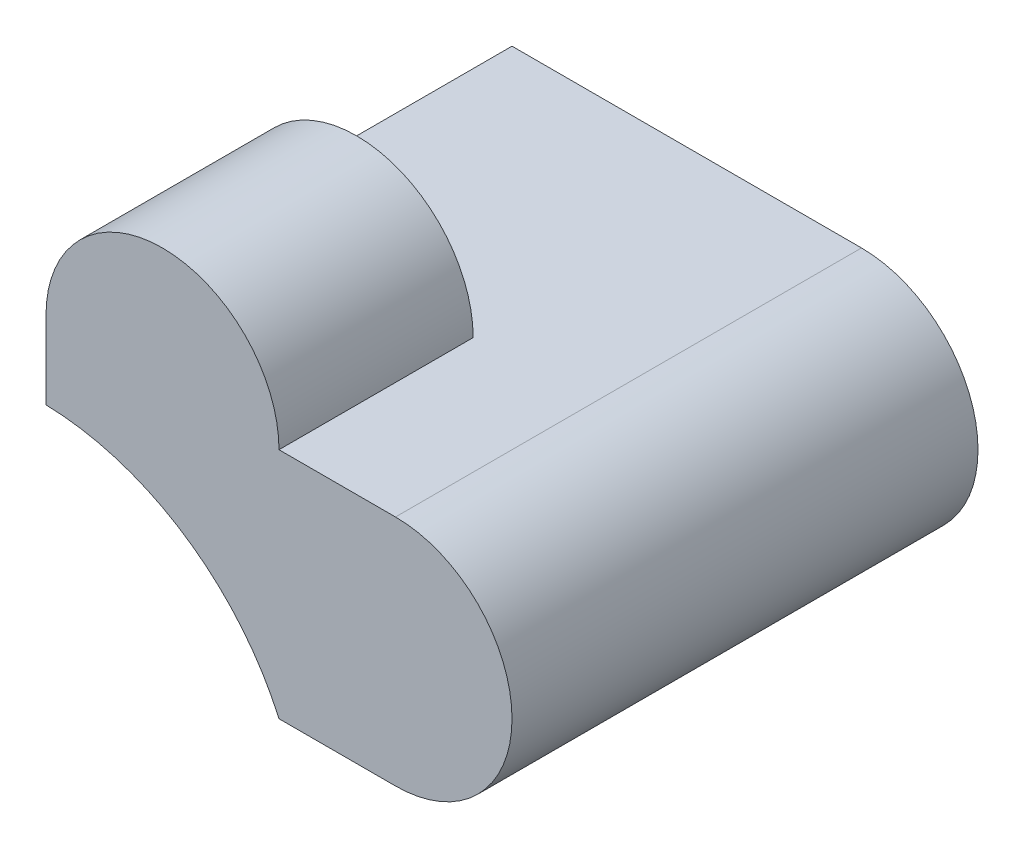
ISO-10303-21;
HEADER;
FILE_DESCRIPTION(('STEP AP214'),'2;1');
FILE_NAME('part.step','',(''),(''),'','','');
FILE_SCHEMA(('AUTOMOTIVE_DESIGN { 1 0 10303 214 1 1 1 1 }'));
ENDSEC;
DATA;
#1=APPLICATION_CONTEXT('core data for automotive mechanical design processes');
#2=APPLICATION_PROTOCOL_DEFINITION('international standard','automotive_design',2000,#1);
#3=PRODUCT_CONTEXT('',#1,'mechanical');
#4=PRODUCT('Part','Part','',(#3));
#5=PRODUCT_RELATED_PRODUCT_CATEGORY('part','',(#4));
#6=PRODUCT_DEFINITION_FORMATION('','',#4);
#7=PRODUCT_DEFINITION_CONTEXT('part definition',#1,'design');
#8=PRODUCT_DEFINITION('design','',#6,#7);
#9=PRODUCT_DEFINITION_SHAPE('','',#8);
#10=(LENGTH_UNIT() NAMED_UNIT(*) SI_UNIT(.MILLI.,.METRE.));
#11=(NAMED_UNIT(*) PLANE_ANGLE_UNIT() SI_UNIT($,.RADIAN.));
#12=(NAMED_UNIT(*) SI_UNIT($,.STERADIAN.) SOLID_ANGLE_UNIT());
#13=UNCERTAINTY_MEASURE_WITH_UNIT(LENGTH_MEASURE(1.E-05),#10,'distance_accuracy_value','');
#14=(GEOMETRIC_REPRESENTATION_CONTEXT(3) GLOBAL_UNCERTAINTY_ASSIGNED_CONTEXT((#13)) GLOBAL_UNIT_ASSIGNED_CONTEXT((#10,
#11,#12)) REPRESENTATION_CONTEXT('',''));
#15=CARTESIAN_POINT('',(0.,0.,0.));
#16=DIRECTION('',(0.,0.,1.));
#17=DIRECTION('',(1.,0.,0.));
#18=AXIS2_PLACEMENT_3D('',#15,#16,#17);
#19=CARTESIAN_POINT('',(0.,0.,0.));
#20=DIRECTION('',(0.,-1.,0.));
#21=DIRECTION('',(0.,0.,-1.));
#22=AXIS2_PLACEMENT_3D('',#19,#20,#21);
#23=PLANE('',#22);
#24=DIRECTION('',(1.,0.,0.));
#25=VECTOR('',#24,1.);
#26=CARTESIAN_POINT('',(-3.,0.,3.));
#27=LINE('',#26,#25);
#28=CARTESIAN_POINT('',(0.,0.,3.));
#29=VERTEX_POINT('',#28);
#30=CARTESIAN_POINT('',(1.5,0.,3.));
#31=VERTEX_POINT('',#30);
#32=EDGE_CURVE('E122',#29,#31,#27,.T.);
#33=ORIENTED_EDGE('',*,*,#32,.F.);
#34=DIRECTION('',(0.,0.,1.));
#35=VECTOR('',#34,1.);
#36=CARTESIAN_POINT('',(0.,0.,0.5));
#37=LINE('',#36,#35);
#38=CARTESIAN_POINT('',(0.,0.,0.5));
#39=VERTEX_POINT('',#38);
#40=EDGE_CURVE('E130',#39,#29,#37,.T.);
#41=ORIENTED_EDGE('',*,*,#40,.F.);
#42=DIRECTION('',(1.,0.,0.));
#43=VECTOR('',#42,1.);
#44=CARTESIAN_POINT('',(0.,0.,0.5));
#45=LINE('',#44,#43);
#46=CARTESIAN_POINT('',(-3.,0.,0.5));
#47=VERTEX_POINT('',#46);
#48=EDGE_CURVE('E121',#47,#39,#45,.T.);
#49=ORIENTED_EDGE('',*,*,#48,.F.);
#50=DIRECTION('',(0.,0.,1.));
#51=VECTOR('',#50,1.);
#52=CARTESIAN_POINT('',(-3.,0.,3.));
#53=LINE('',#52,#51);
#54=CARTESIAN_POINT('',(-3.,0.,-3.));
#55=VERTEX_POINT('',#54);
#56=EDGE_CURVE('E106',#55,#47,#53,.T.);
#57=ORIENTED_EDGE('',*,*,#56,.F.);
#58=DIRECTION('',(-1.,0.,0.));
#59=VECTOR('',#58,1.);
#60=CARTESIAN_POINT('',(-3.,0.,-3.));
#61=LINE('',#60,#59);
#62=CARTESIAN_POINT('',(1.5,0.,-3.));
#63=VERTEX_POINT('',#62);
#64=EDGE_CURVE('E97',#63,#55,#61,.T.);
#65=ORIENTED_EDGE('',*,*,#64,.F.);
#66=DIRECTION('',(0.,0.,1.));
#67=VECTOR('',#66,1.);
#68=CARTESIAN_POINT('',(1.5,0.,-7.));
#69=LINE('',#68,#67);
#70=EDGE_CURVE('E42',#63,#31,#69,.T.);
#71=ORIENTED_EDGE('',*,*,#70,.T.);
#72=EDGE_LOOP('',(#33,#41,#49,#57,#65,#71));
#73=FACE_BOUND('',#72,.T.);
#74=ADVANCED_FACE('F33',(#73),#23,.T.);
#75=CARTESIAN_POINT('',(-3.,5.,3.));
#76=DIRECTION('',(1.,0.,0.));
#77=DIRECTION('',(0.,0.,-1.));
#78=AXIS2_PLACEMENT_3D('',#75,#76,#77);
#79=PLANE('',#78);
#80=DIRECTION('',(0.,0.,1.));
#81=VECTOR('',#80,1.);
#82=CARTESIAN_POINT('',(-3.,2.,0.5));
#83=LINE('',#82,#81);
#84=CARTESIAN_POINT('',(-3.,2.,0.5));
#85=VERTEX_POINT('',#84);
#86=CARTESIAN_POINT('',(-3.,2.,3.));
#87=VERTEX_POINT('',#86);
#88=EDGE_CURVE('E135',#85,#87,#83,.T.);
#89=ORIENTED_EDGE('',*,*,#88,.T.);
#90=DIRECTION('',(0.,-1.,0.));
#91=VECTOR('',#90,1.);
#92=CARTESIAN_POINT('',(-3.,5.,3.));
#93=LINE('',#92,#91);
#94=CARTESIAN_POINT('',(-3.,3.,3.));
#95=VERTEX_POINT('',#94);
#96=EDGE_CURVE('E116',#95,#87,#93,.T.);
#97=ORIENTED_EDGE('',*,*,#96,.F.);
#98=DIRECTION('',(0.,0.,1.));
#99=VECTOR('',#98,1.);
#100=CARTESIAN_POINT('',(-3.,3.,-7.));
#101=LINE('',#100,#99);
#102=CARTESIAN_POINT('',(-3.,3.,0.5));
#103=VERTEX_POINT('',#102);
#104=EDGE_CURVE('E145',#103,#95,#101,.T.);
#105=ORIENTED_EDGE('',*,*,#104,.F.);
#106=CARTESIAN_POINT('',(-3.,3.,-3.));
#107=VERTEX_POINT('',#106);
#108=EDGE_CURVE('E115',#107,#103,#101,.T.);
#109=ORIENTED_EDGE('',*,*,#108,.F.);
#110=DIRECTION('',(0.,-1.,0.));
#111=VECTOR('',#110,1.);
#112=CARTESIAN_POINT('',(-3.,5.,-3.));
#113=LINE('',#112,#111);
#114=EDGE_CURVE('E100',#107,#55,#113,.T.);
#115=ORIENTED_EDGE('',*,*,#114,.T.);
#116=ORIENTED_EDGE('',*,*,#56,.T.);
#117=DIRECTION('',(0.,-1.,0.));
#118=VECTOR('',#117,1.);
#119=CARTESIAN_POINT('',(-3.,0.,0.5));
#120=LINE('',#119,#118);
#121=EDGE_CURVE('E194',#85,#47,#120,.T.);
#122=ORIENTED_EDGE('',*,*,#121,.F.);
#123=EDGE_LOOP('',(#89,#97,#105,#109,#115,#116,#122));
#124=FACE_BOUND('',#123,.T.);
#125=ADVANCED_FACE('F111',(#124),#79,.F.);
#126=CARTESIAN_POINT('',(-3.,5.,-3.));
#127=DIRECTION('',(0.,0.,1.));
#128=DIRECTION('',(1.,0.,0.));
#129=AXIS2_PLACEMENT_3D('',#126,#127,#128);
#130=PLANE('',#129);
#131=ORIENTED_EDGE('',*,*,#114,.F.);
#132=DIRECTION('',(1.,0.,0.));
#133=VECTOR('',#132,1.);
#134=CARTESIAN_POINT('',(-3.,3.,-3.));
#135=LINE('',#134,#133);
#136=CARTESIAN_POINT('',(1.5,3.,-3.));
#137=VERTEX_POINT('',#136);
#138=EDGE_CURVE('E148',#107,#137,#135,.T.);
#139=ORIENTED_EDGE('',*,*,#138,.T.);
#140=CARTESIAN_POINT('',(1.5,1.5,-3.));
#141=DIRECTION('',(0.,0.,1.));
#142=DIRECTION('',(1.,0.,0.));
#143=AXIS2_PLACEMENT_3D('',#140,#141,#142);
#144=CIRCLE('',#143,1.5);
#145=EDGE_CURVE('E101',#63,#137,#144,.T.);
#146=ORIENTED_EDGE('',*,*,#145,.F.);
#147=ORIENTED_EDGE('',*,*,#64,.T.);
#148=EDGE_LOOP('',(#131,#139,#146,#147));
#149=FACE_BOUND('',#148,.T.);
#150=ADVANCED_FACE('F35',(#149),#130,.F.);
#151=CARTESIAN_POINT('',(-3.,5.,3.));
#152=DIRECTION('',(0.,0.,-1.));
#153=DIRECTION('',(-1.,0.,0.));
#154=AXIS2_PLACEMENT_3D('',#151,#152,#153);
#155=PLANE('',#154);
#156=CARTESIAN_POINT('',(-3.08192997799912,-1.37289496699869,3.));
#157=DIRECTION('',(0.,0.,1.));
#158=DIRECTION('',(1.,0.,0.));
#159=AXIS2_PLACEMENT_3D('',#156,#157,#158);
#160=CIRCLE('',#159,3.37388988849666);
#161=EDGE_CURVE('E62',#87,#29,#160,.F.);
#162=ORIENTED_EDGE('',*,*,#161,.T.);
#163=ORIENTED_EDGE('',*,*,#32,.T.);
#164=CARTESIAN_POINT('',(1.5,1.5,3.));
#165=DIRECTION('',(0.,0.,1.));
#166=DIRECTION('',(1.,0.,0.));
#167=AXIS2_PLACEMENT_3D('',#164,#165,#166);
#168=CIRCLE('',#167,1.5);
#169=CARTESIAN_POINT('',(1.5,3.,3.));
#170=VERTEX_POINT('',#169);
#171=EDGE_CURVE('E129',#31,#170,#168,.T.);
#172=ORIENTED_EDGE('',*,*,#171,.T.);
#173=DIRECTION('',(1.,0.,0.));
#174=VECTOR('',#173,1.);
#175=CARTESIAN_POINT('',(0.,3.,3.));
#176=LINE('',#175,#174);
#177=CARTESIAN_POINT('',(0.,3.,3.));
#178=VERTEX_POINT('',#177);
#179=EDGE_CURVE('E142',#178,#170,#176,.T.);
#180=ORIENTED_EDGE('',*,*,#179,.F.);
#181=CARTESIAN_POINT('',(-1.5,3.,3.));
#182=DIRECTION('',(0.,0.,1.));
#183=DIRECTION('',(1.,0.,0.));
#184=AXIS2_PLACEMENT_3D('',#181,#182,#183);
#185=CIRCLE('',#184,1.5);
#186=EDGE_CURVE('E133',#95,#178,#185,.F.);
#187=ORIENTED_EDGE('',*,*,#186,.F.);
#188=ORIENTED_EDGE('',*,*,#96,.T.);
#189=EDGE_LOOP('',(#162,#163,#172,#180,#187,#188));
#190=FACE_BOUND('',#189,.T.);
#191=ADVANCED_FACE('F161',(#190),#155,.F.);
#192=CARTESIAN_POINT('',(1.5,1.5,-7.));
#193=DIRECTION('',(0.,0.,1.));
#194=DIRECTION('',(1.,0.,0.));
#195=AXIS2_PLACEMENT_3D('',#192,#193,#194);
#196=CYLINDRICAL_SURFACE('',#195,1.5);
#197=ORIENTED_EDGE('',*,*,#145,.T.);
#198=DIRECTION('',(0.,0.,1.));
#199=VECTOR('',#198,1.);
#200=CARTESIAN_POINT('',(1.5,3.,-7.));
#201=LINE('',#200,#199);
#202=EDGE_CURVE('E146',#137,#170,#201,.T.);
#203=ORIENTED_EDGE('',*,*,#202,.T.);
#204=ORIENTED_EDGE('',*,*,#171,.F.);
#205=ORIENTED_EDGE('',*,*,#70,.F.);
#206=EDGE_LOOP('',(#197,#203,#204,#205));
#207=FACE_BOUND('',#206,.T.);
#208=ADVANCED_FACE('F154',(#207),#196,.T.);
#209=CARTESIAN_POINT('',(0.,3.,-7.));
#210=DIRECTION('',(0.,-1.,0.));
#211=DIRECTION('',(0.,0.,-1.));
#212=AXIS2_PLACEMENT_3D('',#209,#210,#211);
#213=PLANE('',#212);
#214=ORIENTED_EDGE('',*,*,#179,.T.);
#215=ORIENTED_EDGE('',*,*,#202,.F.);
#216=ORIENTED_EDGE('',*,*,#138,.F.);
#217=ORIENTED_EDGE('',*,*,#108,.T.);
#218=DIRECTION('',(-1.,0.,0.));
#219=VECTOR('',#218,1.);
#220=CARTESIAN_POINT('',(9.5,3.,0.5));
#221=LINE('',#220,#219);
#222=CARTESIAN_POINT('',(0.,3.,0.5));
#223=VERTEX_POINT('',#222);
#224=EDGE_CURVE('E191',#223,#103,#221,.T.);
#225=ORIENTED_EDGE('',*,*,#224,.F.);
#226=DIRECTION('',(0.,0.,1.));
#227=VECTOR('',#226,1.);
#228=CARTESIAN_POINT('',(0.,3.,-7.));
#229=LINE('',#228,#227);
#230=EDGE_CURVE('E149',#223,#178,#229,.T.);
#231=ORIENTED_EDGE('',*,*,#230,.T.);
#232=EDGE_LOOP('',(#214,#215,#216,#217,#225,#231));
#233=FACE_BOUND('',#232,.T.);
#234=ADVANCED_FACE('F157',(#233),#213,.F.);
#235=CARTESIAN_POINT('',(-1.5,3.,-7.));
#236=DIRECTION('',(0.,0.,1.));
#237=DIRECTION('',(1.,0.,0.));
#238=AXIS2_PLACEMENT_3D('',#235,#236,#237);
#239=CYLINDRICAL_SURFACE('',#238,1.5);
#240=ORIENTED_EDGE('',*,*,#230,.F.);
#241=CARTESIAN_POINT('',(-1.5,3.,0.5));
#242=DIRECTION('',(0.,0.,1.));
#243=DIRECTION('',(1.,0.,0.));
#244=AXIS2_PLACEMENT_3D('',#241,#242,#243);
#245=CIRCLE('',#244,1.5);
#246=EDGE_CURVE('E11',#223,#103,#245,.T.);
#247=ORIENTED_EDGE('',*,*,#246,.T.);
#248=ORIENTED_EDGE('',*,*,#104,.T.);
#249=ORIENTED_EDGE('',*,*,#186,.T.);
#250=EDGE_LOOP('',(#240,#247,#248,#249));
#251=FACE_BOUND('',#250,.T.);
#252=ADVANCED_FACE('F175',(#251),#239,.T.);
#253=CARTESIAN_POINT('',(-3.08192997799912,-1.37289496699869,0.5));
#254=DIRECTION('',(0.,0.,1.));
#255=DIRECTION('',(1.,0.,0.));
#256=AXIS2_PLACEMENT_3D('',#253,#254,#255);
#257=CYLINDRICAL_SURFACE('',#256,3.37388988849666);
#258=ORIENTED_EDGE('',*,*,#161,.F.);
#259=ORIENTED_EDGE('',*,*,#88,.F.);
#260=CARTESIAN_POINT('',(-3.08192997799912,-1.37289496699869,0.5));
#261=DIRECTION('',(0.,0.,1.));
#262=DIRECTION('',(1.,0.,0.));
#263=AXIS2_PLACEMENT_3D('',#260,#261,#262);
#264=CIRCLE('',#263,3.37388988849666);
#265=EDGE_CURVE('E50',#85,#39,#264,.F.);
#266=ORIENTED_EDGE('',*,*,#265,.T.);
#267=ORIENTED_EDGE('',*,*,#40,.T.);
#268=EDGE_LOOP('',(#258,#259,#266,#267));
#269=FACE_BOUND('',#268,.T.);
#270=ADVANCED_FACE('F178',(#269),#257,.F.);
#271=CARTESIAN_POINT('',(0.,0.,0.5));
#272=DIRECTION('',(0.,0.,1.));
#273=DIRECTION('',(1.,0.,0.));
#274=AXIS2_PLACEMENT_3D('',#271,#272,#273);
#275=PLANE('',#274);
#276=ORIENTED_EDGE('',*,*,#265,.F.);
#277=ORIENTED_EDGE('',*,*,#121,.T.);
#278=ORIENTED_EDGE('',*,*,#48,.T.);
#279=EDGE_LOOP('',(#276,#277,#278));
#280=FACE_BOUND('',#279,.T.);
#281=ADVANCED_FACE('F184',(#280),#275,.T.);
#282=CARTESIAN_POINT('',(9.5,3.,0.5));
#283=DIRECTION('',(0.,0.,1.));
#284=DIRECTION('',(1.,0.,0.));
#285=AXIS2_PLACEMENT_3D('',#282,#283,#284);
#286=PLANE('',#285);
#287=ORIENTED_EDGE('',*,*,#224,.T.);
#288=ORIENTED_EDGE('',*,*,#246,.F.);
#289=EDGE_LOOP('',(#287,#288));
#290=FACE_BOUND('',#289,.T.);
#291=ADVANCED_FACE('F187',(#290),#286,.F.);
#292=CLOSED_SHELL('',(#74,#125,#150,#191,#208,#234,#252,#270,#281,#291));
#293=MANIFOLD_SOLID_BREP('B2',#292);
#294=ADVANCED_BREP_SHAPE_REPRESENTATION('',(#18,#293),#14);
#295=SHAPE_DEFINITION_REPRESENTATION(#9,#294);
ENDSEC;
END-ISO-10303-21;
